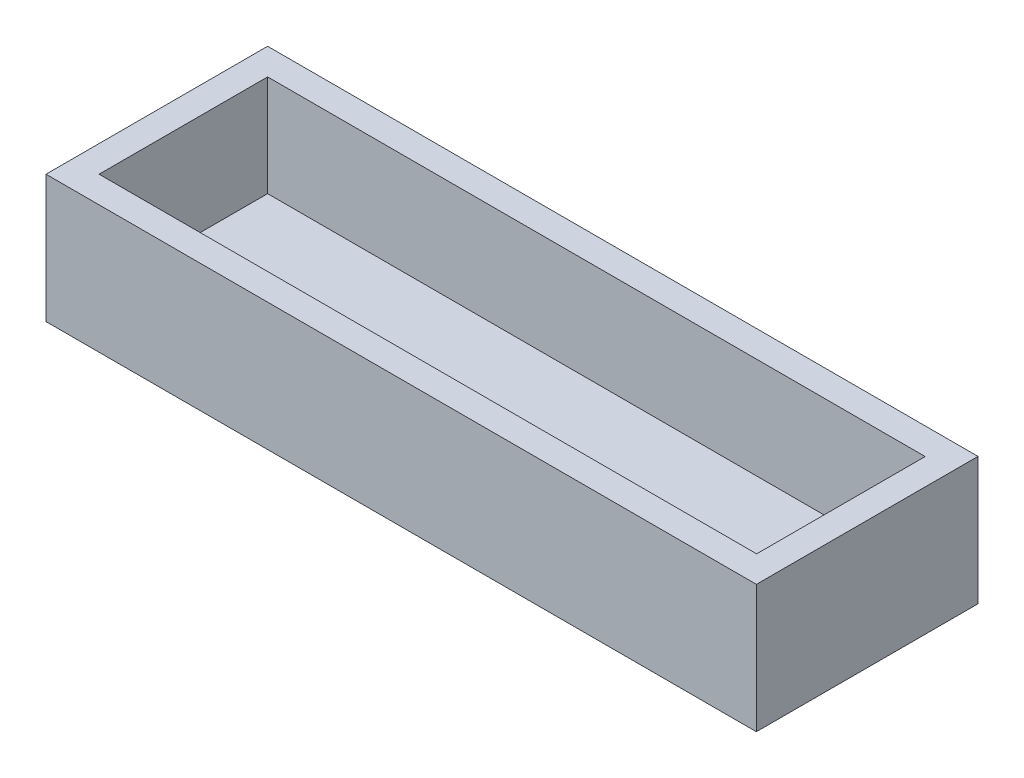
ISO-10303-21;
HEADER;
FILE_DESCRIPTION(('STEP AP214'),'2;1');
FILE_NAME('part.step','',(''),(''),'','','');
FILE_SCHEMA(('AUTOMOTIVE_DESIGN { 1 0 10303 214 1 1 1 1 }'));
ENDSEC;
DATA;
#1=APPLICATION_CONTEXT('core data for automotive mechanical design processes');
#2=APPLICATION_PROTOCOL_DEFINITION('international standard','automotive_design',2000,#1);
#3=PRODUCT_CONTEXT('',#1,'mechanical');
#4=PRODUCT('Part','Part','',(#3));
#5=PRODUCT_RELATED_PRODUCT_CATEGORY('part','',(#4));
#6=PRODUCT_DEFINITION_FORMATION('','',#4);
#7=PRODUCT_DEFINITION_CONTEXT('part definition',#1,'design');
#8=PRODUCT_DEFINITION('design','',#6,#7);
#9=PRODUCT_DEFINITION_SHAPE('','',#8);
#10=(LENGTH_UNIT() NAMED_UNIT(*) SI_UNIT(.MILLI.,.METRE.));
#11=(NAMED_UNIT(*) PLANE_ANGLE_UNIT() SI_UNIT($,.RADIAN.));
#12=(NAMED_UNIT(*) SI_UNIT($,.STERADIAN.) SOLID_ANGLE_UNIT());
#13=UNCERTAINTY_MEASURE_WITH_UNIT(LENGTH_MEASURE(1.E-05),#10,'distance_accuracy_value','');
#14=(GEOMETRIC_REPRESENTATION_CONTEXT(3) GLOBAL_UNCERTAINTY_ASSIGNED_CONTEXT((#13)) GLOBAL_UNIT_ASSIGNED_CONTEXT((#10,
#11,#12)) REPRESENTATION_CONTEXT('',''));
#15=CARTESIAN_POINT('',(0.,0.,0.));
#16=DIRECTION('',(0.,0.,1.));
#17=DIRECTION('',(1.,0.,0.));
#18=AXIS2_PLACEMENT_3D('',#15,#16,#17);
#19=CARTESIAN_POINT('',(133.8250054,10.,-41.7500054));
#20=DIRECTION('',(-1.,0.,0.));
#21=DIRECTION('',(0.,0.,1.));
#22=AXIS2_PLACEMENT_3D('',#19,#20,#21);
#23=PLANE('',#22);
#24=DIRECTION('',(0.,0.,-1.));
#25=VECTOR('',#24,1.);
#26=CARTESIAN_POINT('',(133.8250054,0.,-41.7500054));
#27=LINE('',#26,#25);
#28=CARTESIAN_POINT('',(133.8250054,0.,41.7500054));
#29=VERTEX_POINT('',#28);
#30=CARTESIAN_POINT('',(133.8250054,0.,-41.7500054));
#31=VERTEX_POINT('',#30);
#32=EDGE_CURVE('E132',#29,#31,#27,.T.);
#33=ORIENTED_EDGE('',*,*,#32,.T.);
#34=DIRECTION('',(0.,-1.,0.));
#35=VECTOR('',#34,1.);
#36=CARTESIAN_POINT('',(133.8250054,10.,-41.7500054));
#37=LINE('',#36,#35);
#38=CARTESIAN_POINT('',(133.8250054,48.1,-41.7500054));
#39=VERTEX_POINT('',#38);
#40=EDGE_CURVE('E11',#39,#31,#37,.T.);
#41=ORIENTED_EDGE('',*,*,#40,.F.);
#42=DIRECTION('',(0.,0.,-1.));
#43=VECTOR('',#42,1.);
#44=CARTESIAN_POINT('',(133.8250054,48.1,0.));
#45=LINE('',#44,#43);
#46=CARTESIAN_POINT('',(133.8250054,48.1,41.7500054));
#47=VERTEX_POINT('',#46);
#48=EDGE_CURVE('E180',#47,#39,#45,.T.);
#49=ORIENTED_EDGE('',*,*,#48,.F.);
#50=DIRECTION('',(0.,-1.,0.));
#51=VECTOR('',#50,1.);
#52=CARTESIAN_POINT('',(133.8250054,10.,41.7500054));
#53=LINE('',#52,#51);
#54=EDGE_CURVE('E151',#47,#29,#53,.T.);
#55=ORIENTED_EDGE('',*,*,#54,.T.);
#56=EDGE_LOOP('',(#33,#41,#49,#55));
#57=FACE_BOUND('',#56,.T.);
#58=ADVANCED_FACE('F41',(#57),#23,.F.);
#59=CARTESIAN_POINT('',(-133.8250054,10.,-41.7500054));
#60=DIRECTION('',(0.,0.,1.));
#61=DIRECTION('',(1.,0.,0.));
#62=AXIS2_PLACEMENT_3D('',#59,#60,#61);
#63=PLANE('',#62);
#64=DIRECTION('',(-1.,0.,0.));
#65=VECTOR('',#64,1.);
#66=CARTESIAN_POINT('',(-133.8250054,0.,-41.7500054));
#67=LINE('',#66,#65);
#68=CARTESIAN_POINT('',(-133.8250054,0.,-41.7500054));
#69=VERTEX_POINT('',#68);
#70=EDGE_CURVE('E137',#31,#69,#67,.T.);
#71=ORIENTED_EDGE('',*,*,#70,.T.);
#72=DIRECTION('',(0.,-1.,0.));
#73=VECTOR('',#72,1.);
#74=CARTESIAN_POINT('',(-133.8250054,10.,-41.7500054));
#75=LINE('',#74,#73);
#76=CARTESIAN_POINT('',(-133.8250054,48.1,-41.7500054));
#77=VERTEX_POINT('',#76);
#78=EDGE_CURVE('E49',#77,#69,#75,.T.);
#79=ORIENTED_EDGE('',*,*,#78,.F.);
#80=DIRECTION('',(-1.,0.,0.));
#81=VECTOR('',#80,1.);
#82=CARTESIAN_POINT('',(0.,48.1,-41.7500054));
#83=LINE('',#82,#81);
#84=EDGE_CURVE('E182',#39,#77,#83,.T.);
#85=ORIENTED_EDGE('',*,*,#84,.F.);
#86=ORIENTED_EDGE('',*,*,#40,.T.);
#87=EDGE_LOOP('',(#71,#79,#85,#86));
#88=FACE_BOUND('',#87,.T.);
#89=ADVANCED_FACE('F213',(#88),#63,.F.);
#90=CARTESIAN_POINT('',(-133.8250054,10.,-41.7500054));
#91=DIRECTION('',(1.,0.,0.));
#92=DIRECTION('',(0.,0.,-1.));
#93=AXIS2_PLACEMENT_3D('',#90,#91,#92);
#94=PLANE('',#93);
#95=DIRECTION('',(0.,0.,1.));
#96=VECTOR('',#95,1.);
#97=CARTESIAN_POINT('',(-133.8250054,0.,-41.7500054));
#98=LINE('',#97,#96);
#99=CARTESIAN_POINT('',(-133.8250054,0.,41.7500054));
#100=VERTEX_POINT('',#99);
#101=EDGE_CURVE('E145',#69,#100,#98,.T.);
#102=ORIENTED_EDGE('',*,*,#101,.T.);
#103=DIRECTION('',(0.,-1.,0.));
#104=VECTOR('',#103,1.);
#105=CARTESIAN_POINT('',(-133.8250054,10.,41.7500054));
#106=LINE('',#105,#104);
#107=CARTESIAN_POINT('',(-133.8250054,48.1,41.7500054));
#108=VERTEX_POINT('',#107);
#109=EDGE_CURVE('E155',#108,#100,#106,.T.);
#110=ORIENTED_EDGE('',*,*,#109,.F.);
#111=DIRECTION('',(0.,0.,1.));
#112=VECTOR('',#111,1.);
#113=CARTESIAN_POINT('',(-133.8250054,48.1,0.));
#114=LINE('',#113,#112);
#115=EDGE_CURVE('E165',#77,#108,#114,.T.);
#116=ORIENTED_EDGE('',*,*,#115,.F.);
#117=ORIENTED_EDGE('',*,*,#78,.T.);
#118=EDGE_LOOP('',(#102,#110,#116,#117));
#119=FACE_BOUND('',#118,.T.);
#120=ADVANCED_FACE('F163',(#119),#94,.F.);
#121=CARTESIAN_POINT('',(-133.8250054,10.,41.7500054));
#122=DIRECTION('',(0.,0.,-1.));
#123=DIRECTION('',(-1.,0.,0.));
#124=AXIS2_PLACEMENT_3D('',#121,#122,#123);
#125=PLANE('',#124);
#126=DIRECTION('',(1.,0.,0.));
#127=VECTOR('',#126,1.);
#128=CARTESIAN_POINT('',(-133.8250054,0.,41.7500054));
#129=LINE('',#128,#127);
#130=EDGE_CURVE('E148',#100,#29,#129,.T.);
#131=ORIENTED_EDGE('',*,*,#130,.T.);
#132=ORIENTED_EDGE('',*,*,#54,.F.);
#133=DIRECTION('',(1.,0.,0.));
#134=VECTOR('',#133,1.);
#135=CARTESIAN_POINT('',(0.,48.1,41.7500054));
#136=LINE('',#135,#134);
#137=EDGE_CURVE('E183',#108,#47,#136,.T.);
#138=ORIENTED_EDGE('',*,*,#137,.F.);
#139=ORIENTED_EDGE('',*,*,#109,.T.);
#140=EDGE_LOOP('',(#131,#132,#138,#139));
#141=FACE_BOUND('',#140,.T.);
#142=ADVANCED_FACE('F174',(#141),#125,.F.);
#143=CARTESIAN_POINT('',(0.,0.,0.));
#144=DIRECTION('',(0.,1.,0.));
#145=DIRECTION('',(0.,0.,1.));
#146=AXIS2_PLACEMENT_3D('',#143,#144,#145);
#147=PLANE('',#146);
#148=ORIENTED_EDGE('',*,*,#32,.F.);
#149=ORIENTED_EDGE('',*,*,#130,.F.);
#150=ORIENTED_EDGE('',*,*,#101,.F.);
#151=ORIENTED_EDGE('',*,*,#70,.F.);
#152=EDGE_LOOP('',(#148,#149,#150,#151));
#153=FACE_BOUND('',#152,.T.);
#154=ADVANCED_FACE('F172',(#153),#147,.F.);
#155=CARTESIAN_POINT('',(123.9190054,48.1,0.));
#156=DIRECTION('',(1.,0.,0.));
#157=DIRECTION('',(0.,0.,-1.));
#158=AXIS2_PLACEMENT_3D('',#155,#156,#157);
#159=PLANE('',#158);
#160=DIRECTION('',(0.,0.,1.));
#161=VECTOR('',#160,1.);
#162=CARTESIAN_POINT('',(123.9190054,10.,0.));
#163=LINE('',#162,#161);
#164=CARTESIAN_POINT('',(123.9190054,10.,-31.7500054));
#165=VERTEX_POINT('',#164);
#166=CARTESIAN_POINT('',(123.9190054,10.,31.7500054));
#167=VERTEX_POINT('',#166);
#168=EDGE_CURVE('E130',#165,#167,#163,.T.);
#169=ORIENTED_EDGE('',*,*,#168,.T.);
#170=DIRECTION('',(0.,-1.,0.));
#171=VECTOR('',#170,1.);
#172=CARTESIAN_POINT('',(123.9190054,48.1,31.7500054));
#173=LINE('',#172,#171);
#174=CARTESIAN_POINT('',(123.9190054,48.1,31.7500054));
#175=VERTEX_POINT('',#174);
#176=EDGE_CURVE('E108',#175,#167,#173,.T.);
#177=ORIENTED_EDGE('',*,*,#176,.F.);
#178=DIRECTION('',(0.,0.,1.));
#179=VECTOR('',#178,1.);
#180=CARTESIAN_POINT('',(123.9190054,48.1,0.));
#181=LINE('',#180,#179);
#182=CARTESIAN_POINT('',(123.9190054,48.1,-31.7500054));
#183=VERTEX_POINT('',#182);
#184=EDGE_CURVE('E116',#183,#175,#181,.T.);
#185=ORIENTED_EDGE('',*,*,#184,.F.);
#186=DIRECTION('',(0.,-1.,0.));
#187=VECTOR('',#186,1.);
#188=CARTESIAN_POINT('',(123.9190054,48.1,-31.7500054));
#189=LINE('',#188,#187);
#190=EDGE_CURVE('E187',#183,#165,#189,.T.);
#191=ORIENTED_EDGE('',*,*,#190,.T.);
#192=EDGE_LOOP('',(#169,#177,#185,#191));
#193=FACE_BOUND('',#192,.T.);
#194=ADVANCED_FACE('F129',(#193),#159,.F.);
#195=CARTESIAN_POINT('',(0.,48.1,31.7500054));
#196=DIRECTION('',(0.,0.,1.));
#197=DIRECTION('',(1.,0.,0.));
#198=AXIS2_PLACEMENT_3D('',#195,#196,#197);
#199=PLANE('',#198);
#200=DIRECTION('',(-1.,0.,0.));
#201=VECTOR('',#200,1.);
#202=CARTESIAN_POINT('',(0.,10.,31.7500054));
#203=LINE('',#202,#201);
#204=CARTESIAN_POINT('',(-123.8250054,10.,31.7500054));
#205=VERTEX_POINT('',#204);
#206=EDGE_CURVE('E56',#167,#205,#203,.T.);
#207=ORIENTED_EDGE('',*,*,#206,.T.);
#208=DIRECTION('',(0.,-1.,0.));
#209=VECTOR('',#208,1.);
#210=CARTESIAN_POINT('',(-123.8250054,48.1,31.7500054));
#211=LINE('',#210,#209);
#212=CARTESIAN_POINT('',(-123.8250054,48.1,31.7500054));
#213=VERTEX_POINT('',#212);
#214=EDGE_CURVE('E110',#213,#205,#211,.T.);
#215=ORIENTED_EDGE('',*,*,#214,.F.);
#216=DIRECTION('',(-1.,0.,0.));
#217=VECTOR('',#216,1.);
#218=CARTESIAN_POINT('',(0.,48.1,31.7500054));
#219=LINE('',#218,#217);
#220=EDGE_CURVE('E104',#175,#213,#219,.T.);
#221=ORIENTED_EDGE('',*,*,#220,.F.);
#222=ORIENTED_EDGE('',*,*,#176,.T.);
#223=EDGE_LOOP('',(#207,#215,#221,#222));
#224=FACE_BOUND('',#223,.T.);
#225=ADVANCED_FACE('F106',(#224),#199,.F.);
#226=CARTESIAN_POINT('',(-123.8250054,48.1,0.));
#227=DIRECTION('',(1.,0.,0.));
#228=DIRECTION('',(0.,0.,-1.));
#229=AXIS2_PLACEMENT_3D('',#226,#227,#228);
#230=PLANE('',#229);
#231=DIRECTION('',(0.,0.,1.));
#232=VECTOR('',#231,1.);
#233=CARTESIAN_POINT('',(-123.8250054,10.,0.));
#234=LINE('',#233,#232);
#235=CARTESIAN_POINT('',(-123.8250054,10.,-31.7500054));
#236=VERTEX_POINT('',#235);
#237=EDGE_CURVE('E61',#236,#205,#234,.T.);
#238=ORIENTED_EDGE('',*,*,#237,.F.);
#239=DIRECTION('',(0.,-1.,0.));
#240=VECTOR('',#239,1.);
#241=CARTESIAN_POINT('',(-123.8250054,48.1,-31.7500054));
#242=LINE('',#241,#240);
#243=CARTESIAN_POINT('',(-123.8250054,48.1,-31.7500054));
#244=VERTEX_POINT('',#243);
#245=EDGE_CURVE('E139',#244,#236,#242,.T.);
#246=ORIENTED_EDGE('',*,*,#245,.F.);
#247=DIRECTION('',(0.,0.,1.));
#248=VECTOR('',#247,1.);
#249=CARTESIAN_POINT('',(-123.8250054,48.1,0.));
#250=LINE('',#249,#248);
#251=EDGE_CURVE('E115',#244,#213,#250,.T.);
#252=ORIENTED_EDGE('',*,*,#251,.T.);
#253=ORIENTED_EDGE('',*,*,#214,.T.);
#254=EDGE_LOOP('',(#238,#246,#252,#253));
#255=FACE_BOUND('',#254,.T.);
#256=ADVANCED_FACE('F207',(#255),#230,.T.);
#257=CARTESIAN_POINT('',(0.,48.1,-31.7500054));
#258=DIRECTION('',(0.,0.,1.));
#259=DIRECTION('',(1.,0.,0.));
#260=AXIS2_PLACEMENT_3D('',#257,#258,#259);
#261=PLANE('',#260);
#262=DIRECTION('',(-1.,0.,0.));
#263=VECTOR('',#262,1.);
#264=CARTESIAN_POINT('',(0.,10.,-31.7500054));
#265=LINE('',#264,#263);
#266=EDGE_CURVE('E127',#165,#236,#265,.T.);
#267=ORIENTED_EDGE('',*,*,#266,.F.);
#268=ORIENTED_EDGE('',*,*,#190,.F.);
#269=DIRECTION('',(-1.,0.,0.));
#270=VECTOR('',#269,1.);
#271=CARTESIAN_POINT('',(0.,48.1,-31.7500054));
#272=LINE('',#271,#270);
#273=EDGE_CURVE('E123',#183,#244,#272,.T.);
#274=ORIENTED_EDGE('',*,*,#273,.T.);
#275=ORIENTED_EDGE('',*,*,#245,.T.);
#276=EDGE_LOOP('',(#267,#268,#274,#275));
#277=FACE_BOUND('',#276,.T.);
#278=ADVANCED_FACE('F205',(#277),#261,.T.);
#279=CARTESIAN_POINT('',(0.,48.1,0.));
#280=DIRECTION('',(0.,1.,0.));
#281=DIRECTION('',(0.,0.,1.));
#282=AXIS2_PLACEMENT_3D('',#279,#280,#281);
#283=PLANE('',#282);
#284=ORIENTED_EDGE('',*,*,#184,.T.);
#285=ORIENTED_EDGE('',*,*,#220,.T.);
#286=ORIENTED_EDGE('',*,*,#251,.F.);
#287=ORIENTED_EDGE('',*,*,#273,.F.);
#288=EDGE_LOOP('',(#284,#285,#286,#287));
#289=FACE_BOUND('',#288,.T.);
#290=ORIENTED_EDGE('',*,*,#115,.T.);
#291=ORIENTED_EDGE('',*,*,#137,.T.);
#292=ORIENTED_EDGE('',*,*,#48,.T.);
#293=ORIENTED_EDGE('',*,*,#84,.T.);
#294=EDGE_LOOP('',(#290,#291,#292,#293));
#295=FACE_BOUND('',#294,.T.);
#296=ADVANCED_FACE('F120',(#289,#295),#283,.T.);
#297=CARTESIAN_POINT('',(0.,10.,0.));
#298=DIRECTION('',(0.,1.,0.));
#299=DIRECTION('',(0.,0.,1.));
#300=AXIS2_PLACEMENT_3D('',#297,#298,#299);
#301=PLANE('',#300);
#302=ORIENTED_EDGE('',*,*,#206,.F.);
#303=ORIENTED_EDGE('',*,*,#168,.F.);
#304=ORIENTED_EDGE('',*,*,#266,.T.);
#305=ORIENTED_EDGE('',*,*,#237,.T.);
#306=EDGE_LOOP('',(#302,#303,#304,#305));
#307=FACE_BOUND('',#306,.T.);
#308=ADVANCED_FACE('F225',(#307),#301,.T.);
#309=CLOSED_SHELL('',(#58,#89,#120,#142,#154,#194,#225,#256,#278,#296,#308));
#310=MANIFOLD_SOLID_BREP('B2',#309);
#311=ADVANCED_BREP_SHAPE_REPRESENTATION('',(#18,#310),#14);
#312=SHAPE_DEFINITION_REPRESENTATION(#9,#311);
ENDSEC;
END-ISO-10303-21;
